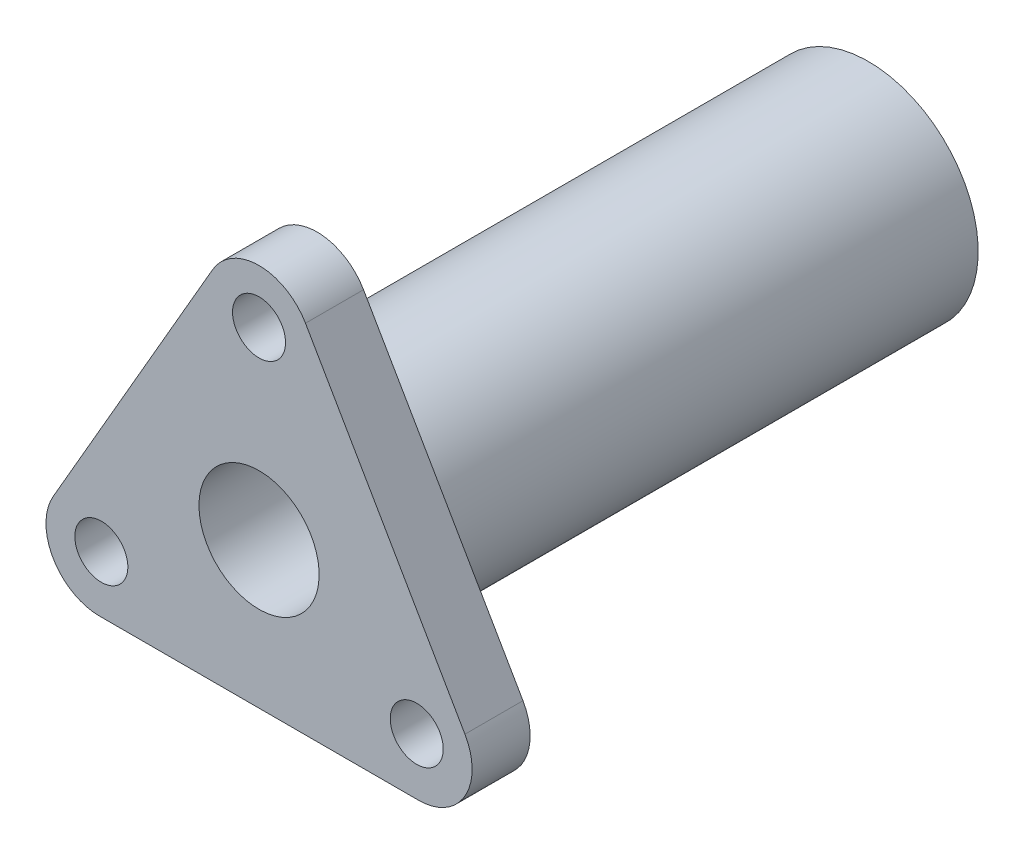
ISO-10303-21;
HEADER;
FILE_DESCRIPTION(('STEP AP214'),'2;1');
FILE_NAME('part.step','',(''),(''),'','','');
FILE_SCHEMA(('AUTOMOTIVE_DESIGN { 1 0 10303 214 1 1 1 1 }'));
ENDSEC;
DATA;
#1=APPLICATION_CONTEXT('core data for automotive mechanical design processes');
#2=APPLICATION_PROTOCOL_DEFINITION('international standard','automotive_design',2000,#1);
#3=PRODUCT_CONTEXT('',#1,'mechanical');
#4=PRODUCT('Part','Part','',(#3));
#5=PRODUCT_RELATED_PRODUCT_CATEGORY('part','',(#4));
#6=PRODUCT_DEFINITION_FORMATION('','',#4);
#7=PRODUCT_DEFINITION_CONTEXT('part definition',#1,'design');
#8=PRODUCT_DEFINITION('design','',#6,#7);
#9=PRODUCT_DEFINITION_SHAPE('','',#8);
#10=(LENGTH_UNIT() NAMED_UNIT(*) SI_UNIT(.MILLI.,.METRE.));
#11=(NAMED_UNIT(*) PLANE_ANGLE_UNIT() SI_UNIT($,.RADIAN.));
#12=(NAMED_UNIT(*) SI_UNIT($,.STERADIAN.) SOLID_ANGLE_UNIT());
#13=UNCERTAINTY_MEASURE_WITH_UNIT(LENGTH_MEASURE(1.E-05),#10,'distance_accuracy_value','');
#14=(GEOMETRIC_REPRESENTATION_CONTEXT(3) GLOBAL_UNCERTAINTY_ASSIGNED_CONTEXT((#13)) GLOBAL_UNIT_ASSIGNED_CONTEXT((#10,
#11,#12)) REPRESENTATION_CONTEXT('',''));
#15=CARTESIAN_POINT('',(0.,0.,0.));
#16=DIRECTION('',(0.,0.,1.));
#17=DIRECTION('',(1.,0.,0.));
#18=AXIS2_PLACEMENT_3D('',#15,#16,#17);
#19=CARTESIAN_POINT('',(-20.0000000000001,-11.5470053837925,4.6));
#20=DIRECTION('',(0.866025403784438,-0.5,0.));
#21=DIRECTION('',(0.5,0.866025403784438,0.));
#22=AXIS2_PLACEMENT_3D('',#19,#20,#21);
#23=PLANE('',#22);
#24=DIRECTION('',(-0.5,-0.866025403784438,0.));
#25=VECTOR('',#24,1.);
#26=CARTESIAN_POINT('',(-20.0000000000001,-11.5470053837925,4.6));
#27=LINE('',#26,#25);
#28=CARTESIAN_POINT('',(-3.68060796608397,16.719010767585,4.6));
#29=VERTEX_POINT('',#28);
#30=CARTESIAN_POINT('',(-16.3193920339162,-5.17200538379253,4.6));
#31=VERTEX_POINT('',#30);
#32=EDGE_CURVE('E106',#29,#31,#27,.T.);
#33=ORIENTED_EDGE('',*,*,#32,.F.);
#34=DIRECTION('',(0.,0.,-1.));
#35=VECTOR('',#34,1.);
#36=CARTESIAN_POINT('',(-3.68060796608397,16.719010767585,4.6));
#37=LINE('',#36,#35);
#38=CARTESIAN_POINT('',(-3.68060796608397,16.719010767585,0.));
#39=VERTEX_POINT('',#38);
#40=EDGE_CURVE('E92',#29,#39,#37,.T.);
#41=ORIENTED_EDGE('',*,*,#40,.T.);
#42=DIRECTION('',(-0.5,-0.866025403784438,0.));
#43=VECTOR('',#42,1.);
#44=CARTESIAN_POINT('',(-20.0000000000001,-11.5470053837925,0.));
#45=LINE('',#44,#43);
#46=CARTESIAN_POINT('',(-16.3193920339162,-5.17200538379253,0.));
#47=VERTEX_POINT('',#46);
#48=EDGE_CURVE('E104',#39,#47,#45,.T.);
#49=ORIENTED_EDGE('',*,*,#48,.T.);
#50=DIRECTION('',(0.,0.,-1.));
#51=VECTOR('',#50,1.);
#52=CARTESIAN_POINT('',(-16.3193920339162,-5.17200538379253,4.6));
#53=LINE('',#52,#51);
#54=EDGE_CURVE('E108',#47,#31,#53,.F.);
#55=ORIENTED_EDGE('',*,*,#54,.T.);
#56=EDGE_LOOP('',(#33,#41,#49,#55));
#57=FACE_BOUND('',#56,.T.);
#58=ADVANCED_FACE('F34',(#57),#23,.F.);
#59=CARTESIAN_POINT('',(20.,-11.5470053837925,4.6));
#60=DIRECTION('',(0.,1.,0.));
#61=DIRECTION('',(-1.,0.,0.));
#62=AXIS2_PLACEMENT_3D('',#59,#60,#61);
#63=PLANE('',#62);
#64=DIRECTION('',(1.,0.,0.));
#65=VECTOR('',#64,1.);
#66=CARTESIAN_POINT('',(20.,-11.5470053837925,4.6));
#67=LINE('',#66,#65);
#68=CARTESIAN_POINT('',(-12.6387840678324,-11.5470053837925,4.6));
#69=VERTEX_POINT('',#68);
#70=CARTESIAN_POINT('',(12.6387840678322,-11.5470053837925,4.6));
#71=VERTEX_POINT('',#70);
#72=EDGE_CURVE('E141',#69,#71,#67,.T.);
#73=ORIENTED_EDGE('',*,*,#72,.F.);
#74=DIRECTION('',(0.,0.,-1.));
#75=VECTOR('',#74,1.);
#76=CARTESIAN_POINT('',(-12.6387840678324,-11.5470053837925,4.6));
#77=LINE('',#76,#75);
#78=CARTESIAN_POINT('',(-12.6387840678324,-11.5470053837925,0.));
#79=VERTEX_POINT('',#78);
#80=EDGE_CURVE('E11',#69,#79,#77,.T.);
#81=ORIENTED_EDGE('',*,*,#80,.T.);
#82=DIRECTION('',(1.,0.,0.));
#83=VECTOR('',#82,1.);
#84=CARTESIAN_POINT('',(20.,-11.5470053837925,0.));
#85=LINE('',#84,#83);
#86=CARTESIAN_POINT('',(12.6387840678322,-11.5470053837925,0.));
#87=VERTEX_POINT('',#86);
#88=EDGE_CURVE('E112',#79,#87,#85,.T.);
#89=ORIENTED_EDGE('',*,*,#88,.T.);
#90=DIRECTION('',(0.,0.,-1.));
#91=VECTOR('',#90,1.);
#92=CARTESIAN_POINT('',(12.6387840678322,-11.5470053837925,4.6));
#93=LINE('',#92,#91);
#94=EDGE_CURVE('E42',#87,#71,#93,.F.);
#95=ORIENTED_EDGE('',*,*,#94,.T.);
#96=EDGE_LOOP('',(#73,#81,#89,#95));
#97=FACE_BOUND('',#96,.T.);
#98=ADVANCED_FACE('F214',(#97),#63,.F.);
#99=CARTESIAN_POINT('',(-1.17496378611944E-13,23.0940107675849,4.6));
#100=DIRECTION('',(-0.866025403784437,-0.500000000000003,0.));
#101=DIRECTION('',(0.500000000000003,-0.866025403784437,0.));
#102=AXIS2_PLACEMENT_3D('',#99,#100,#101);
#103=PLANE('',#102);
#104=DIRECTION('',(-0.500000000000003,0.866025403784437,0.));
#105=VECTOR('',#104,1.);
#106=CARTESIAN_POINT('',(-1.17496378611944E-13,23.0940107675849,0.));
#107=LINE('',#106,#105);
#108=CARTESIAN_POINT('',(16.3193920339161,-5.17200538379252,0.));
#109=VERTEX_POINT('',#108);
#110=CARTESIAN_POINT('',(3.68060796608375,16.719010767585,0.));
#111=VERTEX_POINT('',#110);
#112=EDGE_CURVE('E115',#109,#111,#107,.T.);
#113=ORIENTED_EDGE('',*,*,#112,.T.);
#114=DIRECTION('',(0.,0.,-1.));
#115=VECTOR('',#114,1.);
#116=CARTESIAN_POINT('',(3.68060796608375,16.719010767585,4.6));
#117=LINE('',#116,#115);
#118=CARTESIAN_POINT('',(3.68060796608375,16.719010767585,4.6));
#119=VERTEX_POINT('',#118);
#120=EDGE_CURVE('E93',#111,#119,#117,.F.);
#121=ORIENTED_EDGE('',*,*,#120,.T.);
#122=DIRECTION('',(-0.500000000000003,0.866025403784437,0.));
#123=VECTOR('',#122,1.);
#124=CARTESIAN_POINT('',(-1.17496378611944E-13,23.0940107675849,4.6));
#125=LINE('',#124,#123);
#126=CARTESIAN_POINT('',(16.3193920339161,-5.17200538379252,4.6));
#127=VERTEX_POINT('',#126);
#128=EDGE_CURVE('E121',#127,#119,#125,.T.);
#129=ORIENTED_EDGE('',*,*,#128,.F.);
#130=DIRECTION('',(0.,0.,-1.));
#131=VECTOR('',#130,1.);
#132=CARTESIAN_POINT('',(16.3193920339161,-5.17200538379252,4.6));
#133=LINE('',#132,#131);
#134=EDGE_CURVE('E98',#127,#109,#133,.T.);
#135=ORIENTED_EDGE('',*,*,#134,.T.);
#136=EDGE_LOOP('',(#113,#121,#129,#135));
#137=FACE_BOUND('',#136,.T.);
#138=ADVANCED_FACE('F219',(#137),#103,.F.);
#139=CARTESIAN_POINT('',(0.,0.,4.6));
#140=DIRECTION('',(0.,0.,-1.));
#141=DIRECTION('',(-1.,0.,0.));
#142=AXIS2_PLACEMENT_3D('',#139,#140,#141);
#143=PLANE('',#142);
#144=CARTESIAN_POINT('',(0.,0.,4.6));
#145=DIRECTION('',(0.,0.,-1.));
#146=DIRECTION('',(-1.,0.,0.));
#147=AXIS2_PLACEMENT_3D('',#144,#145,#146);
#148=CIRCLE('',#147,4.7625);
#149=CARTESIAN_POINT('',(-4.7625,0.,4.6));
#150=VERTEX_POINT('',#149);
#151=EDGE_CURVE('E162',#150,#150,#148,.T.);
#152=ORIENTED_EDGE('',*,*,#151,.T.);
#153=EDGE_LOOP('',(#152));
#154=FACE_BOUND('',#153,.T.);
#155=CARTESIAN_POINT('',(0.,14.5940107675849,4.6));
#156=DIRECTION('',(0.,0.,-1.));
#157=DIRECTION('',(-1.,0.,0.));
#158=AXIS2_PLACEMENT_3D('',#155,#156,#157);
#159=CIRCLE('',#158,2.1);
#160=CARTESIAN_POINT('',(-2.09999999999999,14.5940107675849,4.6));
#161=VERTEX_POINT('',#160);
#162=EDGE_CURVE('E152',#161,#161,#159,.T.);
#163=ORIENTED_EDGE('',*,*,#162,.T.);
#164=EDGE_LOOP('',(#163));
#165=FACE_BOUND('',#164,.T.);
#166=CARTESIAN_POINT('',(12.5,-7.05662432702602,4.6));
#167=DIRECTION('',(0.,0.,-1.));
#168=DIRECTION('',(-1.,0.,0.));
#169=AXIS2_PLACEMENT_3D('',#166,#167,#168);
#170=CIRCLE('',#169,2.1);
#171=CARTESIAN_POINT('',(10.4,-7.05662432702602,4.6));
#172=VERTEX_POINT('',#171);
#173=EDGE_CURVE('E146',#172,#172,#170,.T.);
#174=ORIENTED_EDGE('',*,*,#173,.T.);
#175=EDGE_LOOP('',(#174));
#176=FACE_BOUND('',#175,.T.);
#177=CARTESIAN_POINT('',(-12.5,-7.05662432702602,4.6));
#178=DIRECTION('',(0.,0.,-1.));
#179=DIRECTION('',(-1.,0.,0.));
#180=AXIS2_PLACEMENT_3D('',#177,#178,#179);
#181=CIRCLE('',#180,2.1);
#182=CARTESIAN_POINT('',(-14.6,-7.05662432702602,4.6));
#183=VERTEX_POINT('',#182);
#184=EDGE_CURVE('E113',#183,#183,#181,.T.);
#185=ORIENTED_EDGE('',*,*,#184,.T.);
#186=EDGE_LOOP('',(#185));
#187=FACE_BOUND('',#186,.T.);
#188=ORIENTED_EDGE('',*,*,#128,.T.);
#189=CARTESIAN_POINT('',(-1.04083408558608E-13,14.594010767585,4.6));
#190=DIRECTION('',(0.,0.,-1.));
#191=DIRECTION('',(-1.,0.,0.));
#192=AXIS2_PLACEMENT_3D('',#189,#190,#191);
#193=CIRCLE('',#192,4.25);
#194=EDGE_CURVE('E134',#119,#29,#193,.F.);
#195=ORIENTED_EDGE('',*,*,#194,.T.);
#196=ORIENTED_EDGE('',*,*,#32,.T.);
#197=CARTESIAN_POINT('',(-12.6387840678324,-7.29700538379253,4.6));
#198=DIRECTION('',(0.,0.,-1.));
#199=DIRECTION('',(-1.,0.,0.));
#200=AXIS2_PLACEMENT_3D('',#197,#198,#199);
#201=CIRCLE('',#200,4.25);
#202=EDGE_CURVE('E55',#31,#69,#201,.F.);
#203=ORIENTED_EDGE('',*,*,#202,.T.);
#204=ORIENTED_EDGE('',*,*,#72,.T.);
#205=CARTESIAN_POINT('',(12.6387840678322,-7.29700538379253,4.6));
#206=DIRECTION('',(0.,0.,-1.));
#207=DIRECTION('',(-1.,0.,0.));
#208=AXIS2_PLACEMENT_3D('',#205,#206,#207);
#209=CIRCLE('',#208,4.25);
#210=EDGE_CURVE('E131',#71,#127,#209,.F.);
#211=ORIENTED_EDGE('',*,*,#210,.T.);
#212=EDGE_LOOP('',(#188,#195,#196,#203,#204,#211));
#213=FACE_BOUND('',#212,.T.);
#214=ADVANCED_FACE('F136',(#154,#165,#176,#187,#213),#143,.F.);
#215=CARTESIAN_POINT('',(0.,0.,0.));
#216=DIRECTION('',(0.,0.,-1.));
#217=DIRECTION('',(-1.,0.,0.));
#218=AXIS2_PLACEMENT_3D('',#215,#216,#217);
#219=PLANE('',#218);
#220=CARTESIAN_POINT('',(0.,0.,0.));
#221=DIRECTION('',(0.,0.,-1.));
#222=DIRECTION('',(-1.,0.,0.));
#223=AXIS2_PLACEMENT_3D('',#220,#221,#222);
#224=CIRCLE('',#223,8.7);
#225=CARTESIAN_POINT('',(-8.7,0.,0.));
#226=VERTEX_POINT('',#225);
#227=EDGE_CURVE('E159',#226,#226,#224,.T.);
#228=ORIENTED_EDGE('',*,*,#227,.F.);
#229=EDGE_LOOP('',(#228));
#230=FACE_BOUND('',#229,.T.);
#231=CARTESIAN_POINT('',(0.,14.5940107675849,0.));
#232=DIRECTION('',(0.,0.,-1.));
#233=DIRECTION('',(-1.,0.,0.));
#234=AXIS2_PLACEMENT_3D('',#231,#232,#233);
#235=CIRCLE('',#234,2.1);
#236=CARTESIAN_POINT('',(-2.09999999999999,14.5940107675849,0.));
#237=VERTEX_POINT('',#236);
#238=EDGE_CURVE('E155',#237,#237,#235,.T.);
#239=ORIENTED_EDGE('',*,*,#238,.F.);
#240=EDGE_LOOP('',(#239));
#241=FACE_BOUND('',#240,.T.);
#242=CARTESIAN_POINT('',(12.5,-7.05662432702602,0.));
#243=DIRECTION('',(0.,0.,-1.));
#244=DIRECTION('',(-1.,0.,0.));
#245=AXIS2_PLACEMENT_3D('',#242,#243,#244);
#246=CIRCLE('',#245,2.1);
#247=CARTESIAN_POINT('',(10.4,-7.05662432702602,0.));
#248=VERTEX_POINT('',#247);
#249=EDGE_CURVE('E149',#248,#248,#246,.T.);
#250=ORIENTED_EDGE('',*,*,#249,.F.);
#251=EDGE_LOOP('',(#250));
#252=FACE_BOUND('',#251,.T.);
#253=CARTESIAN_POINT('',(-12.5,-7.05662432702602,0.));
#254=DIRECTION('',(0.,0.,-1.));
#255=DIRECTION('',(-1.,0.,0.));
#256=AXIS2_PLACEMENT_3D('',#253,#254,#255);
#257=CIRCLE('',#256,2.1);
#258=CARTESIAN_POINT('',(-14.6,-7.05662432702602,0.));
#259=VERTEX_POINT('',#258);
#260=EDGE_CURVE('E118',#259,#259,#257,.T.);
#261=ORIENTED_EDGE('',*,*,#260,.F.);
#262=EDGE_LOOP('',(#261));
#263=FACE_BOUND('',#262,.T.);
#264=ORIENTED_EDGE('',*,*,#48,.F.);
#265=CARTESIAN_POINT('',(-1.04083408558608E-13,14.594010767585,0.));
#266=DIRECTION('',(0.,0.,-1.));
#267=DIRECTION('',(-1.,0.,0.));
#268=AXIS2_PLACEMENT_3D('',#265,#266,#267);
#269=CIRCLE('',#268,4.25);
#270=EDGE_CURVE('E88',#39,#111,#269,.T.);
#271=ORIENTED_EDGE('',*,*,#270,.T.);
#272=ORIENTED_EDGE('',*,*,#112,.F.);
#273=CARTESIAN_POINT('',(12.6387840678322,-7.29700538379253,0.));
#274=DIRECTION('',(0.,0.,-1.));
#275=DIRECTION('',(-1.,0.,0.));
#276=AXIS2_PLACEMENT_3D('',#273,#274,#275);
#277=CIRCLE('',#276,4.25);
#278=EDGE_CURVE('E107',#109,#87,#277,.T.);
#279=ORIENTED_EDGE('',*,*,#278,.T.);
#280=ORIENTED_EDGE('',*,*,#88,.F.);
#281=CARTESIAN_POINT('',(-12.6387840678324,-7.29700538379253,0.));
#282=DIRECTION('',(0.,0.,-1.));
#283=DIRECTION('',(-1.,0.,0.));
#284=AXIS2_PLACEMENT_3D('',#281,#282,#283);
#285=CIRCLE('',#284,4.25);
#286=EDGE_CURVE('E99',#79,#47,#285,.T.);
#287=ORIENTED_EDGE('',*,*,#286,.T.);
#288=EDGE_LOOP('',(#264,#271,#272,#279,#280,#287));
#289=FACE_BOUND('',#288,.T.);
#290=ADVANCED_FACE('F110',(#230,#241,#252,#263,#289),#219,.T.);
#291=CARTESIAN_POINT('',(-12.5,-7.05662432702602,0.));
#292=DIRECTION('',(0.,0.,-1.));
#293=DIRECTION('',(-1.,0.,0.));
#294=AXIS2_PLACEMENT_3D('',#291,#292,#293);
#295=CYLINDRICAL_SURFACE('',#294,2.1);
#296=ORIENTED_EDGE('',*,*,#184,.F.);
#297=EDGE_LOOP('',(#296));
#298=FACE_BOUND('',#297,.T.);
#299=ORIENTED_EDGE('',*,*,#260,.T.);
#300=EDGE_LOOP('',(#299));
#301=FACE_BOUND('',#300,.T.);
#302=ADVANCED_FACE('F193',(#298,#301),#295,.F.);
#303=CARTESIAN_POINT('',(12.5,-7.05662432702602,0.));
#304=DIRECTION('',(0.,0.,-1.));
#305=DIRECTION('',(-1.,0.,0.));
#306=AXIS2_PLACEMENT_3D('',#303,#304,#305);
#307=CYLINDRICAL_SURFACE('',#306,2.1);
#308=ORIENTED_EDGE('',*,*,#173,.F.);
#309=EDGE_LOOP('',(#308));
#310=FACE_BOUND('',#309,.T.);
#311=ORIENTED_EDGE('',*,*,#249,.T.);
#312=EDGE_LOOP('',(#311));
#313=FACE_BOUND('',#312,.T.);
#314=ADVANCED_FACE('F202',(#310,#313),#307,.F.);
#315=CARTESIAN_POINT('',(0.,14.5940107675849,0.));
#316=DIRECTION('',(0.,0.,-1.));
#317=DIRECTION('',(-1.,0.,0.));
#318=AXIS2_PLACEMENT_3D('',#315,#316,#317);
#319=CYLINDRICAL_SURFACE('',#318,2.1);
#320=ORIENTED_EDGE('',*,*,#162,.F.);
#321=EDGE_LOOP('',(#320));
#322=FACE_BOUND('',#321,.T.);
#323=ORIENTED_EDGE('',*,*,#238,.T.);
#324=EDGE_LOOP('',(#323));
#325=FACE_BOUND('',#324,.T.);
#326=ADVANCED_FACE('F208',(#322,#325),#319,.F.);
#327=CARTESIAN_POINT('',(-1.04083408558608E-13,14.594010767585,4.6));
#328=DIRECTION('',(0.,0.,-1.));
#329=DIRECTION('',(-1.,0.,0.));
#330=AXIS2_PLACEMENT_3D('',#327,#328,#329);
#331=CYLINDRICAL_SURFACE('',#330,4.25);
#332=ORIENTED_EDGE('',*,*,#194,.F.);
#333=ORIENTED_EDGE('',*,*,#120,.F.);
#334=ORIENTED_EDGE('',*,*,#270,.F.);
#335=ORIENTED_EDGE('',*,*,#40,.F.);
#336=EDGE_LOOP('',(#332,#333,#334,#335));
#337=FACE_BOUND('',#336,.T.);
#338=ADVANCED_FACE('F91',(#337),#331,.T.);
#339=CARTESIAN_POINT('',(-12.6387840678324,-7.29700538379253,4.6));
#340=DIRECTION('',(0.,0.,-1.));
#341=DIRECTION('',(-1.,0.,0.));
#342=AXIS2_PLACEMENT_3D('',#339,#340,#341);
#343=CYLINDRICAL_SURFACE('',#342,4.25);
#344=ORIENTED_EDGE('',*,*,#202,.F.);
#345=ORIENTED_EDGE('',*,*,#54,.F.);
#346=ORIENTED_EDGE('',*,*,#286,.F.);
#347=ORIENTED_EDGE('',*,*,#80,.F.);
#348=EDGE_LOOP('',(#344,#345,#346,#347));
#349=FACE_BOUND('',#348,.T.);
#350=ADVANCED_FACE('F224',(#349),#343,.T.);
#351=CARTESIAN_POINT('',(12.6387840678322,-7.29700538379253,4.6));
#352=DIRECTION('',(0.,0.,-1.));
#353=DIRECTION('',(-1.,0.,0.));
#354=AXIS2_PLACEMENT_3D('',#351,#352,#353);
#355=CYLINDRICAL_SURFACE('',#354,4.25);
#356=ORIENTED_EDGE('',*,*,#210,.F.);
#357=ORIENTED_EDGE('',*,*,#94,.F.);
#358=ORIENTED_EDGE('',*,*,#278,.F.);
#359=ORIENTED_EDGE('',*,*,#134,.F.);
#360=EDGE_LOOP('',(#356,#357,#358,#359));
#361=FACE_BOUND('',#360,.T.);
#362=ADVANCED_FACE('F36',(#361),#355,.T.);
#363=CARTESIAN_POINT('',(0.,0.,-43.7));
#364=DIRECTION('',(0.,0.,1.));
#365=DIRECTION('',(1.,0.,0.));
#366=AXIS2_PLACEMENT_3D('',#363,#364,#365);
#367=CYLINDRICAL_SURFACE('',#366,8.7);
#368=CARTESIAN_POINT('',(0.,0.,-43.7));
#369=DIRECTION('',(0.,0.,-1.));
#370=DIRECTION('',(-1.,0.,0.));
#371=AXIS2_PLACEMENT_3D('',#368,#369,#370);
#372=CIRCLE('',#371,8.7);
#373=CARTESIAN_POINT('',(-8.7,0.,-43.7));
#374=VERTEX_POINT('',#373);
#375=EDGE_CURVE('E158',#374,#374,#372,.T.);
#376=ORIENTED_EDGE('',*,*,#375,.F.);
#377=EDGE_LOOP('',(#376));
#378=FACE_BOUND('',#377,.T.);
#379=ORIENTED_EDGE('',*,*,#227,.T.);
#380=EDGE_LOOP('',(#379));
#381=FACE_BOUND('',#380,.T.);
#382=ADVANCED_FACE('F182',(#378,#381),#367,.T.);
#383=CARTESIAN_POINT('',(0.,0.,-43.7));
#384=DIRECTION('',(0.,0.,-1.));
#385=DIRECTION('',(-1.,0.,0.));
#386=AXIS2_PLACEMENT_3D('',#383,#384,#385);
#387=PLANE('',#386);
#388=CARTESIAN_POINT('',(0.,0.,-43.7));
#389=DIRECTION('',(0.,0.,-1.));
#390=DIRECTION('',(-1.,0.,0.));
#391=AXIS2_PLACEMENT_3D('',#388,#389,#390);
#392=CIRCLE('',#391,4.7625);
#393=CARTESIAN_POINT('',(-4.7625,0.,-43.7));
#394=VERTEX_POINT('',#393);
#395=EDGE_CURVE('E165',#394,#394,#392,.T.);
#396=ORIENTED_EDGE('',*,*,#395,.F.);
#397=EDGE_LOOP('',(#396));
#398=FACE_BOUND('',#397,.T.);
#399=ORIENTED_EDGE('',*,*,#375,.T.);
#400=EDGE_LOOP('',(#399));
#401=FACE_BOUND('',#400,.T.);
#402=ADVANCED_FACE('F176',(#398,#401),#387,.T.);
#403=CARTESIAN_POINT('',(0.,0.,4.6));
#404=DIRECTION('',(0.,0.,-1.));
#405=DIRECTION('',(-1.,0.,0.));
#406=AXIS2_PLACEMENT_3D('',#403,#404,#405);
#407=CYLINDRICAL_SURFACE('',#406,4.7625);
#408=ORIENTED_EDGE('',*,*,#151,.F.);
#409=EDGE_LOOP('',(#408));
#410=FACE_BOUND('',#409,.T.);
#411=ORIENTED_EDGE('',*,*,#395,.T.);
#412=EDGE_LOOP('',(#411));
#413=FACE_BOUND('',#412,.T.);
#414=ADVANCED_FACE('F173',(#410,#413),#407,.F.);
#415=CLOSED_SHELL('',(#58,#98,#138,#214,#290,#302,#314,#326,#338,#350,#362,#382,#402,#414));
#416=MANIFOLD_SOLID_BREP('B2',#415);
#417=ADVANCED_BREP_SHAPE_REPRESENTATION('',(#18,#416),#14);
#418=SHAPE_DEFINITION_REPRESENTATION(#9,#417);
ENDSEC;
END-ISO-10303-21;
